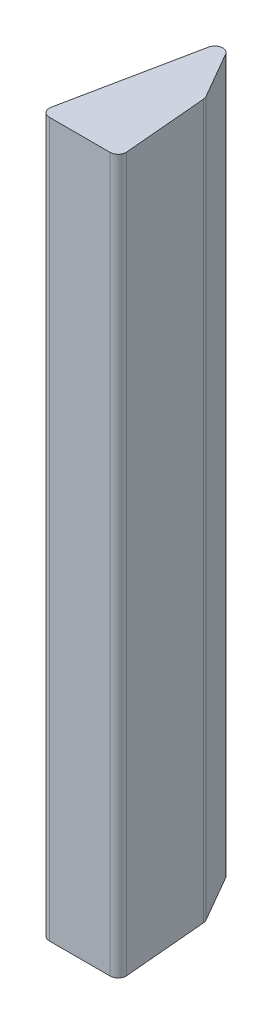
ISO-10303-21;
HEADER;
FILE_DESCRIPTION(('STEP AP214'),'2;1');
FILE_NAME('part.step','',(''),(''),'','','');
FILE_SCHEMA(('AUTOMOTIVE_DESIGN { 1 0 10303 214 1 1 1 1 }'));
ENDSEC;
DATA;
#1=APPLICATION_CONTEXT('core data for automotive mechanical design processes');
#2=APPLICATION_PROTOCOL_DEFINITION('international standard','automotive_design',2000,#1);
#3=PRODUCT_CONTEXT('',#1,'mechanical');
#4=PRODUCT('Part','Part','',(#3));
#5=PRODUCT_RELATED_PRODUCT_CATEGORY('part','',(#4));
#6=PRODUCT_DEFINITION_FORMATION('','',#4);
#7=PRODUCT_DEFINITION_CONTEXT('part definition',#1,'design');
#8=PRODUCT_DEFINITION('design','',#6,#7);
#9=PRODUCT_DEFINITION_SHAPE('','',#8);
#10=(LENGTH_UNIT() NAMED_UNIT(*) SI_UNIT(.MILLI.,.METRE.));
#11=(NAMED_UNIT(*) PLANE_ANGLE_UNIT() SI_UNIT($,.RADIAN.));
#12=(NAMED_UNIT(*) SI_UNIT($,.STERADIAN.) SOLID_ANGLE_UNIT());
#13=UNCERTAINTY_MEASURE_WITH_UNIT(LENGTH_MEASURE(1.E-05),#10,'distance_accuracy_value','');
#14=(GEOMETRIC_REPRESENTATION_CONTEXT(3) GLOBAL_UNCERTAINTY_ASSIGNED_CONTEXT((#13)) GLOBAL_UNIT_ASSIGNED_CONTEXT((#10,
#11,#12)) REPRESENTATION_CONTEXT('',''));
#15=CARTESIAN_POINT('',(0.,0.,0.));
#16=DIRECTION('',(0.,0.,1.));
#17=DIRECTION('',(1.,0.,0.));
#18=AXIS2_PLACEMENT_3D('',#15,#16,#17);
#19=CARTESIAN_POINT('',(-43.8790043489204,450.,-5.));
#20=DIRECTION('',(0.,-1.,0.));
#21=DIRECTION('',(0.,0.,-1.));
#22=AXIS2_PLACEMENT_3D('',#19,#20,#21);
#23=CYLINDRICAL_SURFACE('',#22,5.);
#24=CARTESIAN_POINT('',(-43.8790043489204,0.,-5.));
#25=DIRECTION('',(0.,1.,0.));
#26=DIRECTION('',(0.,0.,-1.));
#27=AXIS2_PLACEMENT_3D('',#24,#25,#26);
#28=CIRCLE('',#27,5.);
#29=CARTESIAN_POINT('',(-48.7784200770088,0.,-5.99786047289202));
#30=VERTEX_POINT('',#29);
#31=CARTESIAN_POINT('',(-43.8790043489204,0.,0.));
#32=VERTEX_POINT('',#31);
#33=EDGE_CURVE('E131',#30,#32,#28,.T.);
#34=ORIENTED_EDGE('',*,*,#33,.T.);
#35=DIRECTION('',(0.,-1.,0.));
#36=VECTOR('',#35,1.);
#37=CARTESIAN_POINT('',(-43.8790043489204,450.,0.));
#38=LINE('',#37,#36);
#39=CARTESIAN_POINT('',(-43.8790043489204,450.,0.));
#40=VERTEX_POINT('',#39);
#41=EDGE_CURVE('E11',#40,#32,#38,.T.);
#42=ORIENTED_EDGE('',*,*,#41,.F.);
#43=CARTESIAN_POINT('',(-43.8790043489204,450.,-5.));
#44=DIRECTION('',(0.,1.,0.));
#45=DIRECTION('',(0.,0.,-1.));
#46=AXIS2_PLACEMENT_3D('',#43,#44,#45);
#47=CIRCLE('',#46,5.);
#48=CARTESIAN_POINT('',(-48.7784200770088,450.,-5.99786047289202));
#49=VERTEX_POINT('',#48);
#50=EDGE_CURVE('E145',#49,#40,#47,.T.);
#51=ORIENTED_EDGE('',*,*,#50,.F.);
#52=DIRECTION('',(0.,-1.,0.));
#53=VECTOR('',#52,1.);
#54=CARTESIAN_POINT('',(-48.7784200770088,450.,-5.99786047289202));
#55=LINE('',#54,#53);
#56=EDGE_CURVE('E127',#49,#30,#55,.T.);
#57=ORIENTED_EDGE('',*,*,#56,.T.);
#58=EDGE_LOOP('',(#34,#42,#51,#57));
#59=FACE_BOUND('',#58,.T.);
#60=ADVANCED_FACE('F35',(#59),#23,.T.);
#61=CARTESIAN_POINT('',(-43.8790043489204,450.,0.));
#62=DIRECTION('',(0.,0.,-1.));
#63=DIRECTION('',(-1.,0.,0.));
#64=AXIS2_PLACEMENT_3D('',#61,#62,#63);
#65=PLANE('',#64);
#66=DIRECTION('',(1.,0.,0.));
#67=VECTOR('',#66,1.);
#68=CARTESIAN_POINT('',(-43.8790043489204,0.,0.));
#69=LINE('',#68,#67);
#70=CARTESIAN_POINT('',(-5.45654250534642,0.,0.));
#71=VERTEX_POINT('',#70);
#72=EDGE_CURVE('E134',#32,#71,#69,.T.);
#73=ORIENTED_EDGE('',*,*,#72,.T.);
#74=DIRECTION('',(0.,-1.,0.));
#75=VECTOR('',#74,1.);
#76=CARTESIAN_POINT('',(-5.45654250534642,450.,0.));
#77=LINE('',#76,#75);
#78=CARTESIAN_POINT('',(-5.45654250534642,450.,0.));
#79=VERTEX_POINT('',#78);
#80=EDGE_CURVE('E43',#79,#71,#77,.T.);
#81=ORIENTED_EDGE('',*,*,#80,.F.);
#82=DIRECTION('',(1.,0.,0.));
#83=VECTOR('',#82,1.);
#84=CARTESIAN_POINT('',(-43.8790043489204,450.,0.));
#85=LINE('',#84,#83);
#86=EDGE_CURVE('E94',#40,#79,#85,.T.);
#87=ORIENTED_EDGE('',*,*,#86,.F.);
#88=ORIENTED_EDGE('',*,*,#41,.T.);
#89=EDGE_LOOP('',(#73,#81,#87,#88));
#90=FACE_BOUND('',#89,.T.);
#91=ADVANCED_FACE('F180',(#90),#65,.F.);
#92=CARTESIAN_POINT('',(-5.45654250534638,450.,-5.));
#93=DIRECTION('',(0.,-1.,0.));
#94=DIRECTION('',(0.,0.,-1.));
#95=AXIS2_PLACEMENT_3D('',#92,#93,#94);
#96=CYLINDRICAL_SURFACE('',#95,5.);
#97=CARTESIAN_POINT('',(-5.45654250534638,0.,-5.));
#98=DIRECTION('',(0.,1.,0.));
#99=DIRECTION('',(0.,0.,-1.));
#100=AXIS2_PLACEMENT_3D('',#97,#98,#99);
#101=CIRCLE('',#100,5.);
#102=CARTESIAN_POINT('',(-0.475569014887654,0.,-5.43577871373835));
#103=VERTEX_POINT('',#102);
#104=EDGE_CURVE('E136',#71,#103,#101,.T.);
#105=ORIENTED_EDGE('',*,*,#104,.T.);
#106=DIRECTION('',(0.,-1.,0.));
#107=VECTOR('',#106,1.);
#108=CARTESIAN_POINT('',(-0.475569014887654,450.,-5.43577871373835));
#109=LINE('',#108,#107);
#110=CARTESIAN_POINT('',(-0.475569014887654,450.,-5.43577871373835));
#111=VERTEX_POINT('',#110);
#112=EDGE_CURVE('E152',#111,#103,#109,.T.);
#113=ORIENTED_EDGE('',*,*,#112,.F.);
#114=CARTESIAN_POINT('',(-5.45654250534638,450.,-5.));
#115=DIRECTION('',(0.,1.,0.));
#116=DIRECTION('',(0.,0.,-1.));
#117=AXIS2_PLACEMENT_3D('',#114,#115,#116);
#118=CIRCLE('',#117,5.);
#119=EDGE_CURVE('E160',#79,#111,#118,.T.);
#120=ORIENTED_EDGE('',*,*,#119,.F.);
#121=ORIENTED_EDGE('',*,*,#80,.T.);
#122=EDGE_LOOP('',(#105,#113,#120,#121));
#123=FACE_BOUND('',#122,.T.);
#124=ADVANCED_FACE('F158',(#123),#96,.T.);
#125=CARTESIAN_POINT('',(-0.475569014887654,450.,-5.43577871373835));
#126=DIRECTION('',(-0.996194698091745,0.,0.0871557427476618));
#127=DIRECTION('',(0.0871557427476618,0.,0.996194698091745));
#128=AXIS2_PLACEMENT_3D('',#125,#126,#127);
#129=PLANE('',#128);
#130=DIRECTION('',(-0.0871557427476618,0.,-0.996194698091745));
#131=VECTOR('',#130,1.);
#132=CARTESIAN_POINT('',(-0.475569014887654,0.,-5.43577871373835));
#133=LINE('',#132,#131);
#134=CARTESIAN_POINT('',(-5.13273474993052,0.,-58.667426647904));
#135=VERTEX_POINT('',#134);
#136=EDGE_CURVE('E138',#103,#135,#133,.T.);
#137=ORIENTED_EDGE('',*,*,#136,.T.);
#138=DIRECTION('',(0.,-1.,0.));
#139=VECTOR('',#138,1.);
#140=CARTESIAN_POINT('',(-5.13273474993052,450.,-58.667426647904));
#141=LINE('',#140,#139);
#142=CARTESIAN_POINT('',(-5.13273474993052,450.,-58.667426647904));
#143=VERTEX_POINT('',#142);
#144=EDGE_CURVE('E149',#143,#135,#141,.T.);
#145=ORIENTED_EDGE('',*,*,#144,.F.);
#146=DIRECTION('',(-0.0871557427476618,0.,-0.996194698091745));
#147=VECTOR('',#146,1.);
#148=CARTESIAN_POINT('',(-0.475569014887654,450.,-5.43577871373835));
#149=LINE('',#148,#147);
#150=EDGE_CURVE('E172',#111,#143,#149,.T.);
#151=ORIENTED_EDGE('',*,*,#150,.F.);
#152=ORIENTED_EDGE('',*,*,#112,.T.);
#153=EDGE_LOOP('',(#137,#145,#151,#152));
#154=FACE_BOUND('',#153,.T.);
#155=ADVANCED_FACE('F168',(#154),#129,.F.);
#156=CARTESIAN_POINT('',(-10.1137082403892,450.,-58.2316479341657));
#157=DIRECTION('',(0.,-1.,0.));
#158=DIRECTION('',(0.,0.,-1.));
#159=AXIS2_PLACEMENT_3D('',#156,#157,#158);
#160=CYLINDRICAL_SURFACE('',#159,5.);
#161=CARTESIAN_POINT('',(-10.1137082403892,0.,-58.2316479341657));
#162=DIRECTION('',(0.,1.,0.));
#163=DIRECTION('',(0.,0.,1.));
#164=AXIS2_PLACEMENT_3D('',#161,#162,#163);
#165=CIRCLE('',#164,5.);
#166=CARTESIAN_POINT('',(-5.78358122146706,0.,-60.7316479341657));
#167=VERTEX_POINT('',#166);
#168=EDGE_CURVE('E140',#135,#167,#165,.T.);
#169=ORIENTED_EDGE('',*,*,#168,.T.);
#170=DIRECTION('',(0.,-1.,0.));
#171=VECTOR('',#170,1.);
#172=CARTESIAN_POINT('',(-5.78358122146706,450.,-60.7316479341657));
#173=LINE('',#172,#171);
#174=CARTESIAN_POINT('',(-5.78358122146706,450.,-60.7316479341657));
#175=VERTEX_POINT('',#174);
#176=EDGE_CURVE('E122',#175,#167,#173,.T.);
#177=ORIENTED_EDGE('',*,*,#176,.F.);
#178=CARTESIAN_POINT('',(-10.1137082403892,450.,-58.2316479341657));
#179=DIRECTION('',(0.,1.,0.));
#180=DIRECTION('',(0.,0.,1.));
#181=AXIS2_PLACEMENT_3D('',#178,#179,#180);
#182=CIRCLE('',#181,5.);
#183=EDGE_CURVE('E113',#143,#175,#182,.T.);
#184=ORIENTED_EDGE('',*,*,#183,.F.);
#185=ORIENTED_EDGE('',*,*,#144,.T.);
#186=EDGE_LOOP('',(#169,#177,#184,#185));
#187=FACE_BOUND('',#186,.T.);
#188=ADVANCED_FACE('F171',(#187),#160,.T.);
#189=CARTESIAN_POINT('',(-5.78358122146706,450.,-60.7316479341657));
#190=DIRECTION('',(-0.866025403784436,0.,0.500000000000004));
#191=DIRECTION('',(0.500000000000004,0.,0.866025403784436));
#192=AXIS2_PLACEMENT_3D('',#189,#190,#191);
#193=PLANE('',#192);
#194=DIRECTION('',(-0.500000000000004,0.,-0.866025403784436));
#195=VECTOR('',#194,1.);
#196=CARTESIAN_POINT('',(-5.78358122146706,0.,-60.7316479341657));
#197=LINE('',#196,#195);
#198=CARTESIAN_POINT('',(-22.7293445648599,0.,-90.08257101796));
#199=VERTEX_POINT('',#198);
#200=EDGE_CURVE('E121',#167,#199,#197,.T.);
#201=ORIENTED_EDGE('',*,*,#200,.T.);
#202=DIRECTION('',(0.,-1.,0.));
#203=VECTOR('',#202,1.);
#204=CARTESIAN_POINT('',(-22.7293445648599,450.,-90.08257101796));
#205=LINE('',#204,#203);
#206=CARTESIAN_POINT('',(-22.7293445648599,450.,-90.08257101796));
#207=VERTEX_POINT('',#206);
#208=EDGE_CURVE('E118',#207,#199,#205,.T.);
#209=ORIENTED_EDGE('',*,*,#208,.F.);
#210=DIRECTION('',(-0.500000000000004,0.,-0.866025403784436));
#211=VECTOR('',#210,1.);
#212=CARTESIAN_POINT('',(-5.78358122146706,450.,-60.7316479341657));
#213=LINE('',#212,#211);
#214=EDGE_CURVE('E107',#175,#207,#213,.T.);
#215=ORIENTED_EDGE('',*,*,#214,.F.);
#216=ORIENTED_EDGE('',*,*,#176,.T.);
#217=EDGE_LOOP('',(#201,#209,#215,#216));
#218=FACE_BOUND('',#217,.T.);
#219=ADVANCED_FACE('F119',(#218),#193,.F.);
#220=CARTESIAN_POINT('',(-27.0594715837821,450.,-87.5825710179599));
#221=DIRECTION('',(0.,-1.,0.));
#222=DIRECTION('',(0.,0.,-1.));
#223=AXIS2_PLACEMENT_3D('',#220,#221,#222);
#224=CYLINDRICAL_SURFACE('',#223,5.);
#225=CARTESIAN_POINT('',(-27.0594715837821,0.,-87.5825710179599));
#226=DIRECTION('',(0.,1.,0.));
#227=DIRECTION('',(0.,0.,1.));
#228=AXIS2_PLACEMENT_3D('',#225,#226,#227);
#229=CIRCLE('',#228,5.);
#230=CARTESIAN_POINT('',(-31.9588873118705,0.,-88.5804314908517));
#231=VERTEX_POINT('',#230);
#232=EDGE_CURVE('E80',#199,#231,#229,.T.);
#233=ORIENTED_EDGE('',*,*,#232,.T.);
#234=DIRECTION('',(0.,-1.,0.));
#235=VECTOR('',#234,1.);
#236=CARTESIAN_POINT('',(-31.9588873118705,450.,-88.5804314908517));
#237=LINE('',#236,#235);
#238=CARTESIAN_POINT('',(-31.9588873118705,450.,-88.5804314908517));
#239=VERTEX_POINT('',#238);
#240=EDGE_CURVE('E123',#239,#231,#237,.T.);
#241=ORIENTED_EDGE('',*,*,#240,.F.);
#242=CARTESIAN_POINT('',(-27.0594715837821,450.,-87.5825710179599));
#243=DIRECTION('',(0.,1.,0.));
#244=DIRECTION('',(0.,0.,1.));
#245=AXIS2_PLACEMENT_3D('',#242,#243,#244);
#246=CIRCLE('',#245,5.);
#247=EDGE_CURVE('E111',#207,#239,#246,.T.);
#248=ORIENTED_EDGE('',*,*,#247,.F.);
#249=ORIENTED_EDGE('',*,*,#208,.T.);
#250=EDGE_LOOP('',(#233,#241,#248,#249));
#251=FACE_BOUND('',#250,.T.);
#252=ADVANCED_FACE('F125',(#251),#224,.T.);
#253=CARTESIAN_POINT('',(-31.9588873118705,450.,-88.5804314908517));
#254=DIRECTION('',(0.979883145617676,0.,0.199572094578395));
#255=DIRECTION('',(0.199572094578395,0.,-0.979883145617676));
#256=AXIS2_PLACEMENT_3D('',#253,#254,#255);
#257=PLANE('',#256);
#258=DIRECTION('',(-0.199572094578395,0.,0.979883145617676));
#259=VECTOR('',#258,1.);
#260=CARTESIAN_POINT('',(-31.9588873118705,0.,-88.5804314908517));
#261=LINE('',#260,#259);
#262=EDGE_CURVE('E86',#231,#30,#261,.T.);
#263=ORIENTED_EDGE('',*,*,#262,.T.);
#264=ORIENTED_EDGE('',*,*,#56,.F.);
#265=DIRECTION('',(-0.199572094578395,0.,0.979883145617676));
#266=VECTOR('',#265,1.);
#267=CARTESIAN_POINT('',(-31.9588873118705,450.,-88.5804314908517));
#268=LINE('',#267,#266);
#269=EDGE_CURVE('E51',#239,#49,#268,.T.);
#270=ORIENTED_EDGE('',*,*,#269,.F.);
#271=ORIENTED_EDGE('',*,*,#240,.T.);
#272=EDGE_LOOP('',(#263,#264,#270,#271));
#273=FACE_BOUND('',#272,.T.);
#274=ADVANCED_FACE('F196',(#273),#257,.F.);
#275=CARTESIAN_POINT('',(-43.8790043489204,450.,-5.));
#276=DIRECTION('',(0.,-1.,0.));
#277=DIRECTION('',(0.,0.,-1.));
#278=AXIS2_PLACEMENT_3D('',#275,#276,#277);
#279=PLANE('',#278);
#280=ORIENTED_EDGE('',*,*,#50,.T.);
#281=ORIENTED_EDGE('',*,*,#86,.T.);
#282=ORIENTED_EDGE('',*,*,#119,.T.);
#283=ORIENTED_EDGE('',*,*,#150,.T.);
#284=ORIENTED_EDGE('',*,*,#183,.T.);
#285=ORIENTED_EDGE('',*,*,#214,.T.);
#286=ORIENTED_EDGE('',*,*,#247,.T.);
#287=ORIENTED_EDGE('',*,*,#269,.T.);
#288=EDGE_LOOP('',(#280,#281,#282,#283,#284,#285,#286,#287));
#289=FACE_BOUND('',#288,.T.);
#290=ADVANCED_FACE('F109',(#289),#279,.F.);
#291=CARTESIAN_POINT('',(-43.8790043489204,0.,-5.));
#292=DIRECTION('',(0.,-1.,0.));
#293=DIRECTION('',(0.,0.,-1.));
#294=AXIS2_PLACEMENT_3D('',#291,#292,#293);
#295=PLANE('',#294);
#296=ORIENTED_EDGE('',*,*,#33,.F.);
#297=ORIENTED_EDGE('',*,*,#262,.F.);
#298=ORIENTED_EDGE('',*,*,#232,.F.);
#299=ORIENTED_EDGE('',*,*,#200,.F.);
#300=ORIENTED_EDGE('',*,*,#168,.F.);
#301=ORIENTED_EDGE('',*,*,#136,.F.);
#302=ORIENTED_EDGE('',*,*,#104,.F.);
#303=ORIENTED_EDGE('',*,*,#72,.F.);
#304=EDGE_LOOP('',(#296,#297,#298,#299,#300,#301,#302,#303));
#305=FACE_BOUND('',#304,.T.);
#306=ADVANCED_FACE('F164',(#305),#295,.T.);
#307=CLOSED_SHELL('',(#60,#91,#124,#155,#188,#219,#252,#274,#290,#306));
#308=MANIFOLD_SOLID_BREP('B2',#307);
#309=ADVANCED_BREP_SHAPE_REPRESENTATION('',(#18,#308),#14);
#310=SHAPE_DEFINITION_REPRESENTATION(#9,#309);
ENDSEC;
END-ISO-10303-21;
